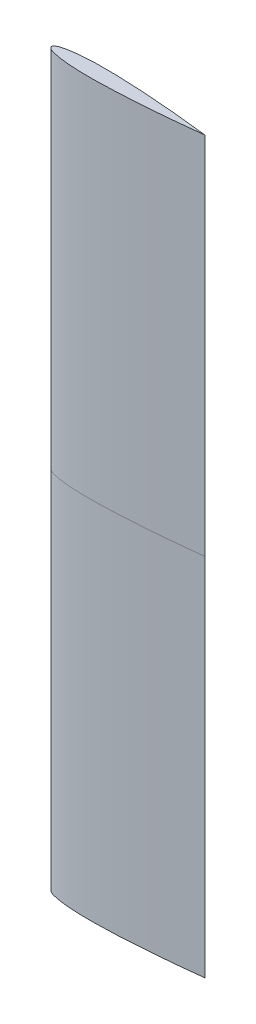
ISO-10303-21;
HEADER;
FILE_DESCRIPTION(('STEP AP214'),'2;1');
FILE_NAME('part.step','',(''),(''),'','','');
FILE_SCHEMA(('AUTOMOTIVE_DESIGN { 1 0 10303 214 1 1 1 1 }'));
ENDSEC;
DATA;
#1=APPLICATION_CONTEXT('core data for automotive mechanical design processes');
#2=APPLICATION_PROTOCOL_DEFINITION('international standard','automotive_design',2000,#1);
#3=PRODUCT_CONTEXT('',#1,'mechanical');
#4=PRODUCT('Part','Part','',(#3));
#5=PRODUCT_RELATED_PRODUCT_CATEGORY('part','',(#4));
#6=PRODUCT_DEFINITION_FORMATION('','',#4);
#7=PRODUCT_DEFINITION_CONTEXT('part definition',#1,'design');
#8=PRODUCT_DEFINITION('design','',#6,#7);
#9=PRODUCT_DEFINITION_SHAPE('','',#8);
#10=(LENGTH_UNIT() NAMED_UNIT(*) SI_UNIT(.MILLI.,.METRE.));
#11=(NAMED_UNIT(*) PLANE_ANGLE_UNIT() SI_UNIT($,.RADIAN.));
#12=(NAMED_UNIT(*) SI_UNIT($,.STERADIAN.) SOLID_ANGLE_UNIT());
#13=UNCERTAINTY_MEASURE_WITH_UNIT(LENGTH_MEASURE(1.E-05),#10,'distance_accuracy_value','');
#14=(GEOMETRIC_REPRESENTATION_CONTEXT(3) GLOBAL_UNCERTAINTY_ASSIGNED_CONTEXT((#13)) GLOBAL_UNIT_ASSIGNED_CONTEXT((#10,
#11,#12)) REPRESENTATION_CONTEXT('',''));
#15=CARTESIAN_POINT('',(0.,0.,0.));
#16=DIRECTION('',(0.,0.,1.));
#17=DIRECTION('',(1.,0.,0.));
#18=AXIS2_PLACEMENT_3D('',#15,#16,#17);
#19=CARTESIAN_POINT('',(123.679544009978,594.,11.0823047088799));
#20=DIRECTION('',(0.,-1.,0.));
#21=DIRECTION('',(0.,0.,-1.));
#22=AXIS2_PLACEMENT_3D('',#19,#20,#21);
#23=PLANE('',#22);
#24=CARTESIAN_POINT('',(0.,594.,0.));
#25=CARTESIAN_POINT('',(0.000103465461850672,594.,0.195763512006859));
#26=CARTESIAN_POINT('',(0.0282937675893524,594.,0.49275948932096));
#27=CARTESIAN_POINT('',(0.127222575715822,594.,0.894156676826667));
#28=CARTESIAN_POINT('',(0.343186548936814,594.,1.37851414413776));
#29=CARTESIAN_POINT('',(0.594318401197752,594.,1.79362736690841));
#30=CARTESIAN_POINT('',(0.950055747207749,594.,2.24992156578818));
#31=CARTESIAN_POINT('',(1.4713817310606,594.,2.77982678568887));
#32=CARTESIAN_POINT('',(2.27928272202513,594.,3.43103542933765));
#33=CARTESIAN_POINT('',(3.60301808997942,594.,4.26867348456868));
#34=CARTESIAN_POINT('',(5.87080256138,594.,5.36694464132199));
#35=CARTESIAN_POINT('',(9.93005594704726,594.,6.81744902969003));
#36=CARTESIAN_POINT('',(17.1522364090774,594.,8.61221967301249));
#37=CARTESIAN_POINT('',(28.7202751218391,594.,10.4478744854177));
#38=CARTESIAN_POINT('',(44.1684650962549,594.,11.8206275366375));
#39=CARTESIAN_POINT('',(62.5424327947028,594.,12.5283181046379));
#40=CARTESIAN_POINT('',(82.333782025023,594.,12.568468879676));
#41=CARTESIAN_POINT('',(99.6449646532138,594.,12.1538260813693));
#42=CARTESIAN_POINT('',(114.474754261623,594.,11.5581675136075));
#43=CARTESIAN_POINT('',(126.826489093191,594.,10.9293163636052));
#44=CARTESIAN_POINT('',(136.704306809029,594.,10.3556638722033));
#45=CARTESIAN_POINT('',(146.577662719965,594.,9.71900697547606));
#46=CARTESIAN_POINT('',(156.448177874923,594.,9.02497718725072));
#47=CARTESIAN_POINT('',(166.313103965573,594.,8.2785317699661));
#48=CARTESIAN_POINT('',(176.177102825749,594.,7.48246039010343));
#49=CARTESIAN_POINT('',(186.032159331356,594.,6.64002112873897));
#50=CARTESIAN_POINT('',(194.659964932203,594.,5.86186982694942));
#51=CARTESIAN_POINT('',(202.039567164669,594.,5.16803750733003));
#52=CARTESIAN_POINT('',(208.208074403685,594.,4.5681769064419));
#53=CARTESIAN_POINT('',(213.104800748353,594.,4.08112666426382));
#54=CARTESIAN_POINT('',(218.075005881044,594.,3.57319925968496));
#55=CARTESIAN_POINT('',(222.911526958763,594.,3.06923205943349));
#56=CARTESIAN_POINT('',(227.970719553252,594.,2.52575020770454));
#57=CARTESIAN_POINT('',(232.65606805684,594.,2.01464323215435));
#58=CARTESIAN_POINT('',(237.956379070475,594.,1.41572539242728));
#59=CARTESIAN_POINT('',(242.233232429836,594.,0.92698262908431));
#60=CARTESIAN_POINT('',(246.711229679291,594.,0.395821130938007));
#61=CARTESIAN_POINT('',(248.883194299176,594.,0.135273090512263));
#62=CARTESIAN_POINT('',(250.000000000002,594.,-1.93104770240191E-13));
#63=B_SPLINE_CURVE_WITH_KNOTS('',4,(#24,#25,#26,#27,#28,#29,#30,#31,#32,#33,#34,#35,#36,#37,#38,
#39,#40,#41,#42,#43,#44,#45,#46,#47,#48,#49,#50,#51,#52,#53,#54,#55,#56,#57,#58,#59,#60,#61,
#62),.UNSPECIFIED.,.F.,.F.,(5,1,1,1,1,1,1,1,1,1,1,1,1,1,1,1,1,1,1,1,1,1,1,1,1,1,1,1,1,1,1,1,1,1,
1,5),(0.,0.00279140045981441,0.00428053383451514,0.00588271915769683,0.00758509894245763,
0.00973465740831715,0.012561594838598,0.0165224026835013,0.022438150700394,0.0321580273460901,
0.0486342403302747,0.0782486520746178,0.129036717083551,0.19999701137119,0.270957306932518,
0.341917602300949,0.412877898163758,0.448358046299363,0.483838194434969,0.519318342597852,
0.554798490760736,0.590278638864112,0.625758786967488,0.661238934992259,0.696719083017031,
0.73219923099426,0.749939304982875,0.76767937897149,0.785419453017184,0.803159527062879,
0.820899601108573,0.838639675154267,0.856379749558805,0.874119823963342,0.89185989836788,
0.909599972772417),.UNSPECIFIED.);
#64=CARTESIAN_POINT('',(0.,594.,0.));
#65=VERTEX_POINT('',#64);
#66=CARTESIAN_POINT('',(250.000000000002,594.,1.93104770240191E-13));
#67=VERTEX_POINT('',#66);
#68=EDGE_CURVE('E91',#65,#67,#63,.T.);
#69=ORIENTED_EDGE('',*,*,#68,.T.);
#70=CARTESIAN_POINT('',(250.000000000002,594.,1.93104770240191E-13));
#71=CARTESIAN_POINT('',(248.883194299176,594.,-0.135273090512263));
#72=CARTESIAN_POINT('',(246.711229679291,594.,-0.395821130938007));
#73=CARTESIAN_POINT('',(242.233232429836,594.,-0.92698262908431));
#74=CARTESIAN_POINT('',(237.956379070475,594.,-1.41572539242728));
#75=CARTESIAN_POINT('',(232.65606805684,594.,-2.01464323215435));
#76=CARTESIAN_POINT('',(227.970719553252,594.,-2.52575020770454));
#77=CARTESIAN_POINT('',(222.911526958763,594.,-3.06923205943349));
#78=CARTESIAN_POINT('',(218.075005881044,594.,-3.57319925968496));
#79=CARTESIAN_POINT('',(213.104800748353,594.,-4.08112666426382));
#80=CARTESIAN_POINT('',(208.208074403685,594.,-4.5681769064419));
#81=CARTESIAN_POINT('',(202.039567164669,594.,-5.16803750733003));
#82=CARTESIAN_POINT('',(194.659964932203,594.,-5.86186982694942));
#83=CARTESIAN_POINT('',(186.032159331356,594.,-6.64002112873897));
#84=CARTESIAN_POINT('',(176.177102825749,594.,-7.48246039010343));
#85=CARTESIAN_POINT('',(166.313103965573,594.,-8.2785317699661));
#86=CARTESIAN_POINT('',(156.448177874923,594.,-9.02497718725072));
#87=CARTESIAN_POINT('',(146.577662719965,594.,-9.71900697547606));
#88=CARTESIAN_POINT('',(136.704306809029,594.,-10.3556638722033));
#89=CARTESIAN_POINT('',(126.826489093191,594.,-10.9293163636052));
#90=CARTESIAN_POINT('',(114.474754261623,594.,-11.5581675136075));
#91=CARTESIAN_POINT('',(99.6449646532138,594.,-12.1538260813693));
#92=CARTESIAN_POINT('',(82.333782025023,594.,-12.568468879676));
#93=CARTESIAN_POINT('',(62.5424327947028,594.,-12.5283181046379));
#94=CARTESIAN_POINT('',(44.1684650962549,594.,-11.8206275366375));
#95=CARTESIAN_POINT('',(28.7202751218391,594.,-10.4478744854177));
#96=CARTESIAN_POINT('',(17.1522364090774,594.,-8.61221967301249));
#97=CARTESIAN_POINT('',(9.93005594704726,594.,-6.81744902969003));
#98=CARTESIAN_POINT('',(5.87080256138,594.,-5.36694464132199));
#99=CARTESIAN_POINT('',(3.60301808997942,594.,-4.26867348456868));
#100=CARTESIAN_POINT('',(2.27928272202513,594.,-3.43103542933765));
#101=CARTESIAN_POINT('',(1.4713817310606,594.,-2.77982678568887));
#102=CARTESIAN_POINT('',(0.950055747207749,594.,-2.24992156578818));
#103=CARTESIAN_POINT('',(0.594318401197752,594.,-1.79362736690841));
#104=CARTESIAN_POINT('',(0.343186548936814,594.,-1.37851414413776));
#105=CARTESIAN_POINT('',(0.127222575715822,594.,-0.894156676826667));
#106=CARTESIAN_POINT('',(0.0282937675893524,594.,-0.49275948932096));
#107=CARTESIAN_POINT('',(0.000103465461850672,594.,-0.195763512006859));
#108=CARTESIAN_POINT('',(0.,594.,0.));
#109=B_SPLINE_CURVE_WITH_KNOTS('',4,(#70,#71,#72,#73,#74,#75,#76,#77,#78,#79,#80,#81,#82,#83,
#84,#85,#86,#87,#88,#89,#90,#91,#92,#93,#94,#95,#96,#97,#98,#99,#100,#101,#102,#103,#104,#105,
#106,#107,#108),.UNSPECIFIED.,.F.,.F.,(5,1,1,1,1,1,1,1,1,1,1,1,1,1,1,1,1,1,1,1,1,1,1,1,1,1,1,1,
1,1,1,1,1,1,1,5),(0.,0.0177400744045375,0.035480148809075,0.0532202232136125,0.07096029761815,
0.0887003716638443,0.106440445709539,0.124180519755233,0.141920593800927,0.159660667789542,
0.177400741778157,0.212880889755386,0.248361037780158,0.28384118580493,0.319321333908306,
0.354801482011681,0.390281630174565,0.425761778337449,0.461241926473054,0.496722074608659,
0.567682370471468,0.638642665839899,0.709602961401227,0.780563255688866,0.831351320697799,
0.860965732442143,0.877441945426327,0.887161822072023,0.893077570088916,0.897038377933819,
0.8998653153641,0.90201487382996,0.90371725361472,0.905319438937902,0.906808572312603,
0.909599972772417),.UNSPECIFIED.);
#110=EDGE_CURVE('E12',#67,#65,#109,.T.);
#111=ORIENTED_EDGE('',*,*,#110,.T.);
#112=EDGE_LOOP('',(#69,#111));
#113=FACE_BOUND('',#112,.T.);
#114=ADVANCED_FACE('F81',(#113),#23,.F.);
#115=CARTESIAN_POINT('',(0.,0.,0.));
#116=CARTESIAN_POINT('',(0.,594.,0.));
#117=CARTESIAN_POINT('',(0.000103465461850672,0.,0.195763512006859));
#118=CARTESIAN_POINT('',(0.000103465461850672,594.,0.195763512006859));
#119=CARTESIAN_POINT('',(0.0282937675893524,0.,0.49275948932096));
#120=CARTESIAN_POINT('',(0.0282937675893524,594.,0.49275948932096));
#121=CARTESIAN_POINT('',(0.127222575715822,0.,0.894156676826667));
#122=CARTESIAN_POINT('',(0.127222575715822,594.,0.894156676826667));
#123=CARTESIAN_POINT('',(0.343186548936814,0.,1.37851414413776));
#124=CARTESIAN_POINT('',(0.343186548936814,594.,1.37851414413776));
#125=CARTESIAN_POINT('',(0.594318401197752,0.,1.79362736690841));
#126=CARTESIAN_POINT('',(0.594318401197752,594.,1.79362736690841));
#127=CARTESIAN_POINT('',(0.950055747207749,0.,2.24992156578818));
#128=CARTESIAN_POINT('',(0.950055747207749,594.,2.24992156578818));
#129=CARTESIAN_POINT('',(1.4713817310606,0.,2.77982678568887));
#130=CARTESIAN_POINT('',(1.4713817310606,594.,2.77982678568887));
#131=CARTESIAN_POINT('',(2.27928272202513,0.,3.43103542933765));
#132=CARTESIAN_POINT('',(2.27928272202513,594.,3.43103542933765));
#133=CARTESIAN_POINT('',(3.60301808997942,0.,4.26867348456868));
#134=CARTESIAN_POINT('',(3.60301808997942,594.,4.26867348456868));
#135=CARTESIAN_POINT('',(5.87080256138,0.,5.36694464132199));
#136=CARTESIAN_POINT('',(5.87080256138,594.,5.36694464132199));
#137=CARTESIAN_POINT('',(9.93005594704726,0.,6.81744902969003));
#138=CARTESIAN_POINT('',(9.93005594704726,594.,6.81744902969003));
#139=CARTESIAN_POINT('',(17.1522364090774,0.,8.61221967301249));
#140=CARTESIAN_POINT('',(17.1522364090774,594.,8.61221967301249));
#141=CARTESIAN_POINT('',(28.7202751218391,0.,10.4478744854177));
#142=CARTESIAN_POINT('',(28.7202751218391,594.,10.4478744854177));
#143=CARTESIAN_POINT('',(44.1684650962549,0.,11.8206275366375));
#144=CARTESIAN_POINT('',(44.1684650962549,594.,11.8206275366375));
#145=CARTESIAN_POINT('',(62.5424327947028,0.,12.5283181046379));
#146=CARTESIAN_POINT('',(62.5424327947028,594.,12.5283181046379));
#147=CARTESIAN_POINT('',(82.333782025023,0.,12.568468879676));
#148=CARTESIAN_POINT('',(82.333782025023,594.,12.568468879676));
#149=CARTESIAN_POINT('',(99.6449646532138,0.,12.1538260813693));
#150=CARTESIAN_POINT('',(99.6449646532138,594.,12.1538260813693));
#151=CARTESIAN_POINT('',(114.474754261623,0.,11.5581675136075));
#152=CARTESIAN_POINT('',(114.474754261623,594.,11.5581675136075));
#153=CARTESIAN_POINT('',(126.826489093191,0.,10.9293163636052));
#154=CARTESIAN_POINT('',(126.826489093191,594.,10.9293163636052));
#155=CARTESIAN_POINT('',(136.704306809029,0.,10.3556638722033));
#156=CARTESIAN_POINT('',(136.704306809029,594.,10.3556638722033));
#157=CARTESIAN_POINT('',(146.577662719965,0.,9.71900697547606));
#158=CARTESIAN_POINT('',(146.577662719965,594.,9.71900697547606));
#159=CARTESIAN_POINT('',(156.448177874923,0.,9.02497718725072));
#160=CARTESIAN_POINT('',(156.448177874923,594.,9.02497718725072));
#161=CARTESIAN_POINT('',(166.313103965573,0.,8.2785317699661));
#162=CARTESIAN_POINT('',(166.313103965573,594.,8.2785317699661));
#163=CARTESIAN_POINT('',(176.177102825749,0.,7.48246039010343));
#164=CARTESIAN_POINT('',(176.177102825749,594.,7.48246039010343));
#165=CARTESIAN_POINT('',(186.032159331356,0.,6.64002112873897));
#166=CARTESIAN_POINT('',(186.032159331356,594.,6.64002112873897));
#167=CARTESIAN_POINT('',(194.659964932203,0.,5.86186982694942));
#168=CARTESIAN_POINT('',(194.659964932203,594.,5.86186982694942));
#169=CARTESIAN_POINT('',(202.039567164669,0.,5.16803750733003));
#170=CARTESIAN_POINT('',(202.039567164669,594.,5.16803750733003));
#171=CARTESIAN_POINT('',(208.208074403685,0.,4.5681769064419));
#172=CARTESIAN_POINT('',(208.208074403685,594.,4.5681769064419));
#173=CARTESIAN_POINT('',(213.104800748353,0.,4.08112666426382));
#174=CARTESIAN_POINT('',(213.104800748353,594.,4.08112666426382));
#175=CARTESIAN_POINT('',(218.075005881044,0.,3.57319925968496));
#176=CARTESIAN_POINT('',(218.075005881044,594.,3.57319925968496));
#177=CARTESIAN_POINT('',(222.911526958763,0.,3.06923205943349));
#178=CARTESIAN_POINT('',(222.911526958763,594.,3.06923205943349));
#179=CARTESIAN_POINT('',(227.970719553252,0.,2.52575020770454));
#180=CARTESIAN_POINT('',(227.970719553252,594.,2.52575020770454));
#181=CARTESIAN_POINT('',(232.65606805684,0.,2.01464323215435));
#182=CARTESIAN_POINT('',(232.65606805684,594.,2.01464323215435));
#183=CARTESIAN_POINT('',(237.956379070475,0.,1.41572539242728));
#184=CARTESIAN_POINT('',(237.956379070475,594.,1.41572539242728));
#185=CARTESIAN_POINT('',(242.233232429836,0.,0.92698262908431));
#186=CARTESIAN_POINT('',(242.233232429836,594.,0.92698262908431));
#187=CARTESIAN_POINT('',(246.711229679291,0.,0.395821130938007));
#188=CARTESIAN_POINT('',(246.711229679291,594.,0.395821130938007));
#189=CARTESIAN_POINT('',(248.883194299176,0.,0.135273090512263));
#190=CARTESIAN_POINT('',(248.883194299176,594.,0.135273090512263));
#191=CARTESIAN_POINT('',(250.000000000002,0.,-1.93104770240191E-13));
#192=CARTESIAN_POINT('',(250.000000000002,594.,-1.93104770240191E-13));
#193=B_SPLINE_SURFACE_WITH_KNOTS('',4,1,((#115,#116),(#117,#118),(#119,#120),(#121,#122),(#123,
#124),(#125,#126),(#127,#128),(#129,#130),(#131,#132),(#133,#134),(#135,#136),(#137,#138),(#139,
#140),(#141,#142),(#143,#144),(#145,#146),(#147,#148),(#149,#150),(#151,#152),(#153,#154),(#155,
#156),(#157,#158),(#159,#160),(#161,#162),(#163,#164),(#165,#166),(#167,#168),(#169,#170),(#171,
#172),(#173,#174),(#175,#176),(#177,#178),(#179,#180),(#181,#182),(#183,#184),(#185,#186),(#187,
#188),(#189,#190),(#191,#192)),.UNSPECIFIED.,.F.,.F.,.F.,(5,1,1,1,1,1,1,1,1,1,1,1,1,1,1,1,1,1,1,
1,1,1,1,1,1,1,1,1,1,1,1,1,1,1,1,5),(2,2),(0.,0.003068822057356,0.00470595202577708,
0.00646736954022391,0.00833893928046041,0.0107021302767264,0.0138100211242431,0.018164471391904,
0.0246681523439404,0.035354032881151,0.0534677240392167,0.0860253456649957,0.141860950908181,
0.219873589883263,0.297886230258619,0.375898870421907,0.453911511128707,0.492917831706601,
0.531924152284496,0.57093047289238,0.609936793500264,0.648943114042727,0.687949434585189,
0.726955755041235,0.765962075497281,0.80496839590106,0.82447155610295,0.843974716304839,
0.863477876569481,0.882981036834123,0.902484197098764,0.921987357363406,0.941490518022555,
0.960993678681703,0.980496839340852,1.),(0.,1.),.UNSPECIFIED.);
#194=CARTESIAN_POINT('',(0.,0.,0.));
#195=CARTESIAN_POINT('',(0.000103465461850672,0.,0.195763512006859));
#196=CARTESIAN_POINT('',(0.0282937675893524,0.,0.49275948932096));
#197=CARTESIAN_POINT('',(0.127222575715822,0.,0.894156676826667));
#198=CARTESIAN_POINT('',(0.343186548936814,0.,1.37851414413776));
#199=CARTESIAN_POINT('',(0.594318401197752,0.,1.79362736690841));
#200=CARTESIAN_POINT('',(0.950055747207749,0.,2.24992156578818));
#201=CARTESIAN_POINT('',(1.4713817310606,0.,2.77982678568887));
#202=CARTESIAN_POINT('',(2.27928272202513,0.,3.43103542933765));
#203=CARTESIAN_POINT('',(3.60301808997942,0.,4.26867348456868));
#204=CARTESIAN_POINT('',(5.87080256138,0.,5.36694464132199));
#205=CARTESIAN_POINT('',(9.93005594704726,0.,6.81744902969003));
#206=CARTESIAN_POINT('',(17.1522364090774,0.,8.61221967301249));
#207=CARTESIAN_POINT('',(28.7202751218391,0.,10.4478744854177));
#208=CARTESIAN_POINT('',(44.1684650962549,0.,11.8206275366375));
#209=CARTESIAN_POINT('',(62.5424327947028,0.,12.5283181046379));
#210=CARTESIAN_POINT('',(82.333782025023,0.,12.568468879676));
#211=CARTESIAN_POINT('',(99.6449646532138,0.,12.1538260813693));
#212=CARTESIAN_POINT('',(114.474754261623,0.,11.5581675136075));
#213=CARTESIAN_POINT('',(126.826489093191,0.,10.9293163636052));
#214=CARTESIAN_POINT('',(136.704306809029,0.,10.3556638722033));
#215=CARTESIAN_POINT('',(146.577662719965,0.,9.71900697547606));
#216=CARTESIAN_POINT('',(156.448177874923,0.,9.02497718725072));
#217=CARTESIAN_POINT('',(166.313103965573,0.,8.2785317699661));
#218=CARTESIAN_POINT('',(176.177102825749,0.,7.48246039010343));
#219=CARTESIAN_POINT('',(186.032159331356,0.,6.64002112873897));
#220=CARTESIAN_POINT('',(194.659964932203,0.,5.86186982694942));
#221=CARTESIAN_POINT('',(202.039567164669,0.,5.16803750733003));
#222=CARTESIAN_POINT('',(208.208074403685,0.,4.5681769064419));
#223=CARTESIAN_POINT('',(213.104800748353,0.,4.08112666426382));
#224=CARTESIAN_POINT('',(218.075005881044,0.,3.57319925968496));
#225=CARTESIAN_POINT('',(222.911526958763,0.,3.06923205943349));
#226=CARTESIAN_POINT('',(227.970719553252,0.,2.52575020770454));
#227=CARTESIAN_POINT('',(232.65606805684,0.,2.01464323215435));
#228=CARTESIAN_POINT('',(237.956379070475,0.,1.41572539242728));
#229=CARTESIAN_POINT('',(242.233232429836,0.,0.92698262908431));
#230=CARTESIAN_POINT('',(246.711229679291,0.,0.395821130938007));
#231=CARTESIAN_POINT('',(248.883194299176,0.,0.135273090512263));
#232=CARTESIAN_POINT('',(250.000000000002,0.,-1.93104770240191E-13));
#233=B_SPLINE_CURVE_WITH_KNOTS('',4,(#194,#195,#196,#197,#198,#199,#200,#201,#202,#203,#204,
#205,#206,#207,#208,#209,#210,#211,#212,#213,#214,#215,#216,#217,#218,#219,#220,#221,#222,#223,
#224,#225,#226,#227,#228,#229,#230,#231,#232),.UNSPECIFIED.,.F.,.F.,(5,1,1,1,1,1,1,1,1,1,1,1,1,
1,1,1,1,1,1,1,1,1,1,1,1,1,1,1,1,1,1,1,1,1,1,5),(0.,0.00279140045981441,0.00428053383451514,
0.00588271915769683,0.00758509894245763,0.00973465740831715,0.012561594838598,
0.0165224026835013,0.022438150700394,0.0321580273460901,0.0486342403302747,0.0782486520746178,
0.129036717083551,0.19999701137119,0.270957306932518,0.341917602300949,0.412877898163758,
0.448358046299363,0.483838194434969,0.519318342597852,0.554798490760736,0.590278638864112,
0.625758786967488,0.661238934992259,0.696719083017031,0.73219923099426,0.749939304982875,
0.76767937897149,0.785419453017184,0.803159527062879,0.820899601108573,0.838639675154267,
0.856379749558805,0.874119823963342,0.89185989836788,0.909599972772417),.UNSPECIFIED.);
#234=CARTESIAN_POINT('',(0.,0.,0.));
#235=VERTEX_POINT('',#234);
#236=CARTESIAN_POINT('',(250.000000000002,0.,1.93104770240191E-13));
#237=VERTEX_POINT('',#236);
#238=EDGE_CURVE('E85',#235,#237,#233,.T.);
#239=DIRECTION('',(0.,1.,0.));
#240=VECTOR('',#239,1.);
#241=CARTESIAN_POINT('',(250.000000000002,297.,-1.93104770240191E-13));
#242=LINE('',#241,#240);
#243=EDGE_CURVE('E99',#237,#67,#242,.T.);
#244=DIRECTION('',(0.,-1.,0.));
#245=VECTOR('',#244,1.);
#246=CARTESIAN_POINT('',(0.,297.,0.));
#247=LINE('',#246,#245);
#248=EDGE_CURVE('E139',#65,#235,#247,.T.);
#249=ORIENTED_EDGE('',*,*,#238,.T.);
#250=ORIENTED_EDGE('',*,*,#243,.T.);
#251=ORIENTED_EDGE('',*,*,#68,.F.);
#252=ORIENTED_EDGE('',*,*,#248,.T.);
#253=EDGE_LOOP('',(#249,#250,#251,#252));
#254=FACE_BOUND('',#253,.T.);
#255=ADVANCED_FACE('F142',(#254),#193,.T.);
#256=CARTESIAN_POINT('',(250.000000000002,0.,1.93104770240191E-13));
#257=CARTESIAN_POINT('',(250.000000000002,594.,1.93104770240191E-13));
#258=CARTESIAN_POINT('',(248.883194299176,0.,-0.135273090512263));
#259=CARTESIAN_POINT('',(248.883194299176,594.,-0.135273090512263));
#260=CARTESIAN_POINT('',(246.711229679291,0.,-0.395821130938007));
#261=CARTESIAN_POINT('',(246.711229679291,594.,-0.395821130938007));
#262=CARTESIAN_POINT('',(242.233232429836,0.,-0.92698262908431));
#263=CARTESIAN_POINT('',(242.233232429836,594.,-0.92698262908431));
#264=CARTESIAN_POINT('',(237.956379070475,0.,-1.41572539242728));
#265=CARTESIAN_POINT('',(237.956379070475,594.,-1.41572539242728));
#266=CARTESIAN_POINT('',(232.65606805684,0.,-2.01464323215435));
#267=CARTESIAN_POINT('',(232.65606805684,594.,-2.01464323215435));
#268=CARTESIAN_POINT('',(227.970719553252,0.,-2.52575020770454));
#269=CARTESIAN_POINT('',(227.970719553252,594.,-2.52575020770454));
#270=CARTESIAN_POINT('',(222.911526958763,0.,-3.06923205943349));
#271=CARTESIAN_POINT('',(222.911526958763,594.,-3.06923205943349));
#272=CARTESIAN_POINT('',(218.075005881044,0.,-3.57319925968496));
#273=CARTESIAN_POINT('',(218.075005881044,594.,-3.57319925968496));
#274=CARTESIAN_POINT('',(213.104800748353,0.,-4.08112666426382));
#275=CARTESIAN_POINT('',(213.104800748353,594.,-4.08112666426382));
#276=CARTESIAN_POINT('',(208.208074403685,0.,-4.5681769064419));
#277=CARTESIAN_POINT('',(208.208074403685,594.,-4.5681769064419));
#278=CARTESIAN_POINT('',(202.039567164669,0.,-5.16803750733003));
#279=CARTESIAN_POINT('',(202.039567164669,594.,-5.16803750733003));
#280=CARTESIAN_POINT('',(194.659964932203,0.,-5.86186982694942));
#281=CARTESIAN_POINT('',(194.659964932203,594.,-5.86186982694942));
#282=CARTESIAN_POINT('',(186.032159331356,0.,-6.64002112873897));
#283=CARTESIAN_POINT('',(186.032159331356,594.,-6.64002112873897));
#284=CARTESIAN_POINT('',(176.177102825749,0.,-7.48246039010343));
#285=CARTESIAN_POINT('',(176.177102825749,594.,-7.48246039010343));
#286=CARTESIAN_POINT('',(166.313103965573,0.,-8.2785317699661));
#287=CARTESIAN_POINT('',(166.313103965573,594.,-8.2785317699661));
#288=CARTESIAN_POINT('',(156.448177874923,0.,-9.02497718725072));
#289=CARTESIAN_POINT('',(156.448177874923,594.,-9.02497718725072));
#290=CARTESIAN_POINT('',(146.577662719965,0.,-9.71900697547606));
#291=CARTESIAN_POINT('',(146.577662719965,594.,-9.71900697547606));
#292=CARTESIAN_POINT('',(136.704306809029,0.,-10.3556638722033));
#293=CARTESIAN_POINT('',(136.704306809029,594.,-10.3556638722033));
#294=CARTESIAN_POINT('',(126.826489093191,0.,-10.9293163636052));
#295=CARTESIAN_POINT('',(126.826489093191,594.,-10.9293163636052));
#296=CARTESIAN_POINT('',(114.474754261623,0.,-11.5581675136075));
#297=CARTESIAN_POINT('',(114.474754261623,594.,-11.5581675136075));
#298=CARTESIAN_POINT('',(99.6449646532138,0.,-12.1538260813693));
#299=CARTESIAN_POINT('',(99.6449646532138,594.,-12.1538260813693));
#300=CARTESIAN_POINT('',(82.333782025023,0.,-12.568468879676));
#301=CARTESIAN_POINT('',(82.333782025023,594.,-12.568468879676));
#302=CARTESIAN_POINT('',(62.5424327947028,0.,-12.5283181046379));
#303=CARTESIAN_POINT('',(62.5424327947028,594.,-12.5283181046379));
#304=CARTESIAN_POINT('',(44.1684650962549,0.,-11.8206275366375));
#305=CARTESIAN_POINT('',(44.1684650962549,594.,-11.8206275366375));
#306=CARTESIAN_POINT('',(28.7202751218391,0.,-10.4478744854177));
#307=CARTESIAN_POINT('',(28.7202751218391,594.,-10.4478744854177));
#308=CARTESIAN_POINT('',(17.1522364090774,0.,-8.61221967301249));
#309=CARTESIAN_POINT('',(17.1522364090774,594.,-8.61221967301249));
#310=CARTESIAN_POINT('',(9.93005594704726,0.,-6.81744902969003));
#311=CARTESIAN_POINT('',(9.93005594704726,594.,-6.81744902969003));
#312=CARTESIAN_POINT('',(5.87080256138,0.,-5.36694464132199));
#313=CARTESIAN_POINT('',(5.87080256138,594.,-5.36694464132199));
#314=CARTESIAN_POINT('',(3.60301808997942,0.,-4.26867348456868));
#315=CARTESIAN_POINT('',(3.60301808997942,594.,-4.26867348456868));
#316=CARTESIAN_POINT('',(2.27928272202513,0.,-3.43103542933765));
#317=CARTESIAN_POINT('',(2.27928272202513,594.,-3.43103542933765));
#318=CARTESIAN_POINT('',(1.4713817310606,0.,-2.77982678568887));
#319=CARTESIAN_POINT('',(1.4713817310606,594.,-2.77982678568887));
#320=CARTESIAN_POINT('',(0.950055747207749,0.,-2.24992156578818));
#321=CARTESIAN_POINT('',(0.950055747207749,594.,-2.24992156578818));
#322=CARTESIAN_POINT('',(0.594318401197752,0.,-1.79362736690841));
#323=CARTESIAN_POINT('',(0.594318401197752,594.,-1.79362736690841));
#324=CARTESIAN_POINT('',(0.343186548936814,0.,-1.37851414413776));
#325=CARTESIAN_POINT('',(0.343186548936814,594.,-1.37851414413776));
#326=CARTESIAN_POINT('',(0.127222575715822,0.,-0.894156676826667));
#327=CARTESIAN_POINT('',(0.127222575715822,594.,-0.894156676826667));
#328=CARTESIAN_POINT('',(0.0282937675893524,0.,-0.49275948932096));
#329=CARTESIAN_POINT('',(0.0282937675893524,594.,-0.49275948932096));
#330=CARTESIAN_POINT('',(0.000103465461850672,0.,-0.195763512006859));
#331=CARTESIAN_POINT('',(0.000103465461850672,594.,-0.195763512006859));
#332=CARTESIAN_POINT('',(0.,0.,0.));
#333=CARTESIAN_POINT('',(0.,594.,0.));
#334=B_SPLINE_SURFACE_WITH_KNOTS('',4,1,((#256,#257),(#258,#259),(#260,#261),(#262,#263),(#264,
#265),(#266,#267),(#268,#269),(#270,#271),(#272,#273),(#274,#275),(#276,#277),(#278,#279),(#280,
#281),(#282,#283),(#284,#285),(#286,#287),(#288,#289),(#290,#291),(#292,#293),(#294,#295),(#296,
#297),(#298,#299),(#300,#301),(#302,#303),(#304,#305),(#306,#307),(#308,#309),(#310,#311),(#312,
#313),(#314,#315),(#316,#317),(#318,#319),(#320,#321),(#322,#323),(#324,#325),(#326,#327),(#328,
#329),(#330,#331),(#332,#333)),.UNSPECIFIED.,.F.,.F.,.F.,(5,1,1,1,1,1,1,1,1,1,1,1,1,1,1,1,1,1,1,
1,1,1,1,1,1,1,1,1,1,1,1,1,1,1,1,5),(2,2),(0.,0.0195031606591484,0.0390063213182969,
0.0585094819774453,0.0780126426365938,0.0975158029012355,0.117018963165877,0.136522123430519,
0.156025283695161,0.175528443897051,0.19503160409894,0.234037924502719,0.273044244958765,
0.312050565414811,0.351056885957273,0.390063206499736,0.42906952710762,0.468075847715504,
0.507082168293399,0.546088488871293,0.624101129578093,0.702113769741381,0.780126410116737,
0.858139049091819,0.913974654335004,0.946532275960783,0.964645967118849,0.97533184765606,
0.981835528608096,0.986189978875757,0.989297869723274,0.99166106071954,0.993532630459776,
0.995294047974223,0.996931177942644,1.),(0.,1.),.UNSPECIFIED.);
#335=CARTESIAN_POINT('',(250.000000000002,0.,1.93104770240191E-13));
#336=CARTESIAN_POINT('',(248.883194299176,0.,-0.135273090512263));
#337=CARTESIAN_POINT('',(246.711229679291,0.,-0.395821130938007));
#338=CARTESIAN_POINT('',(242.233232429836,0.,-0.92698262908431));
#339=CARTESIAN_POINT('',(237.956379070475,0.,-1.41572539242728));
#340=CARTESIAN_POINT('',(232.65606805684,0.,-2.01464323215435));
#341=CARTESIAN_POINT('',(227.970719553252,0.,-2.52575020770454));
#342=CARTESIAN_POINT('',(222.911526958763,0.,-3.06923205943349));
#343=CARTESIAN_POINT('',(218.075005881044,0.,-3.57319925968496));
#344=CARTESIAN_POINT('',(213.104800748353,0.,-4.08112666426382));
#345=CARTESIAN_POINT('',(208.208074403685,0.,-4.5681769064419));
#346=CARTESIAN_POINT('',(202.039567164669,0.,-5.16803750733003));
#347=CARTESIAN_POINT('',(194.659964932203,0.,-5.86186982694942));
#348=CARTESIAN_POINT('',(186.032159331356,0.,-6.64002112873897));
#349=CARTESIAN_POINT('',(176.177102825749,0.,-7.48246039010343));
#350=CARTESIAN_POINT('',(166.313103965573,0.,-8.2785317699661));
#351=CARTESIAN_POINT('',(156.448177874923,0.,-9.02497718725072));
#352=CARTESIAN_POINT('',(146.577662719965,0.,-9.71900697547606));
#353=CARTESIAN_POINT('',(136.704306809029,0.,-10.3556638722033));
#354=CARTESIAN_POINT('',(126.826489093191,0.,-10.9293163636052));
#355=CARTESIAN_POINT('',(114.474754261623,0.,-11.5581675136075));
#356=CARTESIAN_POINT('',(99.6449646532138,0.,-12.1538260813693));
#357=CARTESIAN_POINT('',(82.333782025023,0.,-12.568468879676));
#358=CARTESIAN_POINT('',(62.5424327947028,0.,-12.5283181046379));
#359=CARTESIAN_POINT('',(44.1684650962549,0.,-11.8206275366375));
#360=CARTESIAN_POINT('',(28.7202751218391,0.,-10.4478744854177));
#361=CARTESIAN_POINT('',(17.1522364090774,0.,-8.61221967301249));
#362=CARTESIAN_POINT('',(9.93005594704726,0.,-6.81744902969003));
#363=CARTESIAN_POINT('',(5.87080256138,0.,-5.36694464132199));
#364=CARTESIAN_POINT('',(3.60301808997942,0.,-4.26867348456868));
#365=CARTESIAN_POINT('',(2.27928272202513,0.,-3.43103542933765));
#366=CARTESIAN_POINT('',(1.4713817310606,0.,-2.77982678568887));
#367=CARTESIAN_POINT('',(0.950055747207749,0.,-2.24992156578818));
#368=CARTESIAN_POINT('',(0.594318401197752,0.,-1.79362736690841));
#369=CARTESIAN_POINT('',(0.343186548936814,0.,-1.37851414413776));
#370=CARTESIAN_POINT('',(0.127222575715822,0.,-0.894156676826667));
#371=CARTESIAN_POINT('',(0.0282937675893524,0.,-0.49275948932096));
#372=CARTESIAN_POINT('',(0.000103465461850672,0.,-0.195763512006859));
#373=CARTESIAN_POINT('',(0.,0.,0.));
#374=B_SPLINE_CURVE_WITH_KNOTS('',4,(#335,#336,#337,#338,#339,#340,#341,#342,#343,#344,#345,
#346,#347,#348,#349,#350,#351,#352,#353,#354,#355,#356,#357,#358,#359,#360,#361,#362,#363,#364,
#365,#366,#367,#368,#369,#370,#371,#372,#373),.UNSPECIFIED.,.F.,.F.,(5,1,1,1,1,1,1,1,1,1,1,1,1,
1,1,1,1,1,1,1,1,1,1,1,1,1,1,1,1,1,1,1,1,1,1,5),(0.,0.0177400744045375,0.035480148809075,
0.0532202232136125,0.07096029761815,0.0887003716638443,0.106440445709539,0.124180519755233,
0.141920593800927,0.159660667789542,0.177400741778157,0.212880889755386,0.248361037780158,
0.28384118580493,0.319321333908306,0.354801482011681,0.390281630174565,0.425761778337449,
0.461241926473054,0.496722074608659,0.567682370471468,0.638642665839899,0.709602961401227,
0.780563255688866,0.831351320697799,0.860965732442143,0.877441945426327,0.887161822072023,
0.893077570088916,0.897038377933819,0.8998653153641,0.90201487382996,0.90371725361472,
0.905319438937902,0.906808572312603,0.909599972772417),.UNSPECIFIED.);
#375=EDGE_CURVE('E132',#237,#235,#374,.T.);
#376=ORIENTED_EDGE('',*,*,#375,.T.);
#377=ORIENTED_EDGE('',*,*,#248,.F.);
#378=ORIENTED_EDGE('',*,*,#110,.F.);
#379=ORIENTED_EDGE('',*,*,#243,.F.);
#380=EDGE_LOOP('',(#376,#377,#378,#379));
#381=FACE_BOUND('',#380,.T.);
#382=ADVANCED_FACE('F146',(#381),#334,.T.);
#383=CARTESIAN_POINT('',(123.679544009978,-594.,11.0823047088799));
#384=DIRECTION('',(0.,1.,0.));
#385=DIRECTION('',(0.,0.,-1.));
#386=AXIS2_PLACEMENT_3D('',#383,#384,#385);
#387=PLANE('',#386);
#388=CARTESIAN_POINT('',(0.,-594.,0.));
#389=CARTESIAN_POINT('',(0.000103465461850672,-594.,0.195763512006859));
#390=CARTESIAN_POINT('',(0.0282937675893524,-594.,0.49275948932096));
#391=CARTESIAN_POINT('',(0.127222575715822,-594.,0.894156676826667));
#392=CARTESIAN_POINT('',(0.343186548936814,-594.,1.37851414413776));
#393=CARTESIAN_POINT('',(0.594318401197752,-594.,1.79362736690841));
#394=CARTESIAN_POINT('',(0.950055747207749,-594.,2.24992156578818));
#395=CARTESIAN_POINT('',(1.4713817310606,-594.,2.77982678568887));
#396=CARTESIAN_POINT('',(2.27928272202513,-594.,3.43103542933765));
#397=CARTESIAN_POINT('',(3.60301808997942,-594.,4.26867348456868));
#398=CARTESIAN_POINT('',(5.87080256138,-594.,5.36694464132199));
#399=CARTESIAN_POINT('',(9.93005594704726,-594.,6.81744902969003));
#400=CARTESIAN_POINT('',(17.1522364090774,-594.,8.61221967301249));
#401=CARTESIAN_POINT('',(28.7202751218391,-594.,10.4478744854177));
#402=CARTESIAN_POINT('',(44.1684650962549,-594.,11.8206275366375));
#403=CARTESIAN_POINT('',(62.5424327947028,-594.,12.5283181046379));
#404=CARTESIAN_POINT('',(82.333782025023,-594.,12.568468879676));
#405=CARTESIAN_POINT('',(99.6449646532138,-594.,12.1538260813693));
#406=CARTESIAN_POINT('',(114.474754261623,-594.,11.5581675136075));
#407=CARTESIAN_POINT('',(126.826489093191,-594.,10.9293163636052));
#408=CARTESIAN_POINT('',(136.704306809029,-594.,10.3556638722033));
#409=CARTESIAN_POINT('',(146.577662719965,-594.,9.71900697547606));
#410=CARTESIAN_POINT('',(156.448177874923,-594.,9.02497718725072));
#411=CARTESIAN_POINT('',(166.313103965573,-594.,8.2785317699661));
#412=CARTESIAN_POINT('',(176.177102825749,-594.,7.48246039010343));
#413=CARTESIAN_POINT('',(186.032159331356,-594.,6.64002112873897));
#414=CARTESIAN_POINT('',(194.659964932203,-594.,5.86186982694942));
#415=CARTESIAN_POINT('',(202.039567164669,-594.,5.16803750733003));
#416=CARTESIAN_POINT('',(208.208074403685,-594.,4.5681769064419));
#417=CARTESIAN_POINT('',(213.104800748353,-594.,4.08112666426382));
#418=CARTESIAN_POINT('',(218.075005881044,-594.,3.57319925968496));
#419=CARTESIAN_POINT('',(222.911526958763,-594.,3.06923205943349));
#420=CARTESIAN_POINT('',(227.970719553252,-594.,2.52575020770454));
#421=CARTESIAN_POINT('',(232.65606805684,-594.,2.01464323215435));
#422=CARTESIAN_POINT('',(237.956379070475,-594.,1.41572539242728));
#423=CARTESIAN_POINT('',(242.233232429836,-594.,0.92698262908431));
#424=CARTESIAN_POINT('',(246.711229679291,-594.,0.395821130938007));
#425=CARTESIAN_POINT('',(248.883194299176,-594.,0.135273090512263));
#426=CARTESIAN_POINT('',(250.000000000002,-594.,-1.93104770240191E-13));
#427=B_SPLINE_CURVE_WITH_KNOTS('',4,(#388,#389,#390,#391,#392,#393,#394,#395,#396,#397,#398,
#399,#400,#401,#402,#403,#404,#405,#406,#407,#408,#409,#410,#411,#412,#413,#414,#415,#416,#417,
#418,#419,#420,#421,#422,#423,#424,#425,#426),.UNSPECIFIED.,.F.,.F.,(5,1,1,1,1,1,1,1,1,1,1,1,1,
1,1,1,1,1,1,1,1,1,1,1,1,1,1,1,1,1,1,1,1,1,1,5),(0.,0.00279140045981441,0.00428053383451514,
0.00588271915769683,0.00758509894245763,0.00973465740831715,0.012561594838598,
0.0165224026835013,0.022438150700394,0.0321580273460901,0.0486342403302747,0.0782486520746178,
0.129036717083551,0.19999701137119,0.270957306932518,0.341917602300949,0.412877898163758,
0.448358046299363,0.483838194434969,0.519318342597852,0.554798490760736,0.590278638864112,
0.625758786967488,0.661238934992259,0.696719083017031,0.73219923099426,0.749939304982875,
0.76767937897149,0.785419453017184,0.803159527062879,0.820899601108573,0.838639675154267,
0.856379749558805,0.874119823963342,0.89185989836788,0.909599972772417),.UNSPECIFIED.);
#428=CARTESIAN_POINT('',(0.,-594.,0.));
#429=VERTEX_POINT('',#428);
#430=CARTESIAN_POINT('',(250.000000000002,-594.,1.93104770240191E-13));
#431=VERTEX_POINT('',#430);
#432=EDGE_CURVE('E124',#429,#431,#427,.T.);
#433=ORIENTED_EDGE('',*,*,#432,.F.);
#434=CARTESIAN_POINT('',(250.000000000002,-594.,1.93104770240191E-13));
#435=CARTESIAN_POINT('',(248.883194299176,-594.,-0.135273090512263));
#436=CARTESIAN_POINT('',(246.711229679291,-594.,-0.395821130938007));
#437=CARTESIAN_POINT('',(242.233232429836,-594.,-0.92698262908431));
#438=CARTESIAN_POINT('',(237.956379070475,-594.,-1.41572539242728));
#439=CARTESIAN_POINT('',(232.65606805684,-594.,-2.01464323215435));
#440=CARTESIAN_POINT('',(227.970719553252,-594.,-2.52575020770454));
#441=CARTESIAN_POINT('',(222.911526958763,-594.,-3.06923205943349));
#442=CARTESIAN_POINT('',(218.075005881044,-594.,-3.57319925968496));
#443=CARTESIAN_POINT('',(213.104800748353,-594.,-4.08112666426382));
#444=CARTESIAN_POINT('',(208.208074403685,-594.,-4.5681769064419));
#445=CARTESIAN_POINT('',(202.039567164669,-594.,-5.16803750733003));
#446=CARTESIAN_POINT('',(194.659964932203,-594.,-5.86186982694942));
#447=CARTESIAN_POINT('',(186.032159331356,-594.,-6.64002112873897));
#448=CARTESIAN_POINT('',(176.177102825749,-594.,-7.48246039010343));
#449=CARTESIAN_POINT('',(166.313103965573,-594.,-8.2785317699661));
#450=CARTESIAN_POINT('',(156.448177874923,-594.,-9.02497718725072));
#451=CARTESIAN_POINT('',(146.577662719965,-594.,-9.71900697547606));
#452=CARTESIAN_POINT('',(136.704306809029,-594.,-10.3556638722033));
#453=CARTESIAN_POINT('',(126.826489093191,-594.,-10.9293163636052));
#454=CARTESIAN_POINT('',(114.474754261623,-594.,-11.5581675136075));
#455=CARTESIAN_POINT('',(99.6449646532138,-594.,-12.1538260813693));
#456=CARTESIAN_POINT('',(82.333782025023,-594.,-12.568468879676));
#457=CARTESIAN_POINT('',(62.5424327947028,-594.,-12.5283181046379));
#458=CARTESIAN_POINT('',(44.1684650962549,-594.,-11.8206275366375));
#459=CARTESIAN_POINT('',(28.7202751218391,-594.,-10.4478744854177));
#460=CARTESIAN_POINT('',(17.1522364090774,-594.,-8.61221967301249));
#461=CARTESIAN_POINT('',(9.93005594704726,-594.,-6.81744902969003));
#462=CARTESIAN_POINT('',(5.87080256138,-594.,-5.36694464132199));
#463=CARTESIAN_POINT('',(3.60301808997942,-594.,-4.26867348456868));
#464=CARTESIAN_POINT('',(2.27928272202513,-594.,-3.43103542933765));
#465=CARTESIAN_POINT('',(1.4713817310606,-594.,-2.77982678568887));
#466=CARTESIAN_POINT('',(0.950055747207749,-594.,-2.24992156578818));
#467=CARTESIAN_POINT('',(0.594318401197752,-594.,-1.79362736690841));
#468=CARTESIAN_POINT('',(0.343186548936814,-594.,-1.37851414413776));
#469=CARTESIAN_POINT('',(0.127222575715822,-594.,-0.894156676826667));
#470=CARTESIAN_POINT('',(0.0282937675893524,-594.,-0.49275948932096));
#471=CARTESIAN_POINT('',(0.000103465461850672,-594.,-0.195763512006859));
#472=CARTESIAN_POINT('',(0.,-594.,0.));
#473=B_SPLINE_CURVE_WITH_KNOTS('',4,(#434,#435,#436,#437,#438,#439,#440,#441,#442,#443,#444,
#445,#446,#447,#448,#449,#450,#451,#452,#453,#454,#455,#456,#457,#458,#459,#460,#461,#462,#463,
#464,#465,#466,#467,#468,#469,#470,#471,#472),.UNSPECIFIED.,.F.,.F.,(5,1,1,1,1,1,1,1,1,1,1,1,1,
1,1,1,1,1,1,1,1,1,1,1,1,1,1,1,1,1,1,1,1,1,1,5),(0.,0.0177400744045375,0.035480148809075,
0.0532202232136125,0.07096029761815,0.0887003716638443,0.106440445709539,0.124180519755233,
0.141920593800927,0.159660667789542,0.177400741778157,0.212880889755386,0.248361037780158,
0.28384118580493,0.319321333908306,0.354801482011681,0.390281630174565,0.425761778337449,
0.461241926473054,0.496722074608659,0.567682370471468,0.638642665839899,0.709602961401227,
0.780563255688866,0.831351320697799,0.860965732442143,0.877441945426327,0.887161822072023,
0.893077570088916,0.897038377933819,0.8998653153641,0.90201487382996,0.90371725361472,
0.905319438937902,0.906808572312603,0.909599972772417),.UNSPECIFIED.);
#474=EDGE_CURVE('E143',#431,#429,#473,.T.);
#475=ORIENTED_EDGE('',*,*,#474,.F.);
#476=EDGE_LOOP('',(#433,#475));
#477=FACE_BOUND('',#476,.T.);
#478=ADVANCED_FACE('F168',(#477),#387,.F.);
#479=CARTESIAN_POINT('',(0.,0.,0.));
#480=CARTESIAN_POINT('',(0.,-594.,0.));
#481=CARTESIAN_POINT('',(0.000103465461850672,0.,0.195763512006859));
#482=CARTESIAN_POINT('',(0.000103465461850672,-594.,0.195763512006859));
#483=CARTESIAN_POINT('',(0.0282937675893524,0.,0.49275948932096));
#484=CARTESIAN_POINT('',(0.0282937675893524,-594.,0.49275948932096));
#485=CARTESIAN_POINT('',(0.127222575715822,0.,0.894156676826667));
#486=CARTESIAN_POINT('',(0.127222575715822,-594.,0.894156676826667));
#487=CARTESIAN_POINT('',(0.343186548936814,0.,1.37851414413776));
#488=CARTESIAN_POINT('',(0.343186548936814,-594.,1.37851414413776));
#489=CARTESIAN_POINT('',(0.594318401197752,0.,1.79362736690841));
#490=CARTESIAN_POINT('',(0.594318401197752,-594.,1.79362736690841));
#491=CARTESIAN_POINT('',(0.950055747207749,0.,2.24992156578818));
#492=CARTESIAN_POINT('',(0.950055747207749,-594.,2.24992156578818));
#493=CARTESIAN_POINT('',(1.4713817310606,0.,2.77982678568887));
#494=CARTESIAN_POINT('',(1.4713817310606,-594.,2.77982678568887));
#495=CARTESIAN_POINT('',(2.27928272202513,0.,3.43103542933765));
#496=CARTESIAN_POINT('',(2.27928272202513,-594.,3.43103542933765));
#497=CARTESIAN_POINT('',(3.60301808997942,0.,4.26867348456868));
#498=CARTESIAN_POINT('',(3.60301808997942,-594.,4.26867348456868));
#499=CARTESIAN_POINT('',(5.87080256138,0.,5.36694464132199));
#500=CARTESIAN_POINT('',(5.87080256138,-594.,5.36694464132199));
#501=CARTESIAN_POINT('',(9.93005594704726,0.,6.81744902969003));
#502=CARTESIAN_POINT('',(9.93005594704726,-594.,6.81744902969003));
#503=CARTESIAN_POINT('',(17.1522364090774,0.,8.61221967301249));
#504=CARTESIAN_POINT('',(17.1522364090774,-594.,8.61221967301249));
#505=CARTESIAN_POINT('',(28.7202751218391,0.,10.4478744854177));
#506=CARTESIAN_POINT('',(28.7202751218391,-594.,10.4478744854177));
#507=CARTESIAN_POINT('',(44.1684650962549,0.,11.8206275366375));
#508=CARTESIAN_POINT('',(44.1684650962549,-594.,11.8206275366375));
#509=CARTESIAN_POINT('',(62.5424327947028,0.,12.5283181046379));
#510=CARTESIAN_POINT('',(62.5424327947028,-594.,12.5283181046379));
#511=CARTESIAN_POINT('',(82.333782025023,0.,12.568468879676));
#512=CARTESIAN_POINT('',(82.333782025023,-594.,12.568468879676));
#513=CARTESIAN_POINT('',(99.6449646532138,0.,12.1538260813693));
#514=CARTESIAN_POINT('',(99.6449646532138,-594.,12.1538260813693));
#515=CARTESIAN_POINT('',(114.474754261623,0.,11.5581675136075));
#516=CARTESIAN_POINT('',(114.474754261623,-594.,11.5581675136075));
#517=CARTESIAN_POINT('',(126.826489093191,0.,10.9293163636052));
#518=CARTESIAN_POINT('',(126.826489093191,-594.,10.9293163636052));
#519=CARTESIAN_POINT('',(136.704306809029,0.,10.3556638722033));
#520=CARTESIAN_POINT('',(136.704306809029,-594.,10.3556638722033));
#521=CARTESIAN_POINT('',(146.577662719965,0.,9.71900697547606));
#522=CARTESIAN_POINT('',(146.577662719965,-594.,9.71900697547606));
#523=CARTESIAN_POINT('',(156.448177874923,0.,9.02497718725072));
#524=CARTESIAN_POINT('',(156.448177874923,-594.,9.02497718725072));
#525=CARTESIAN_POINT('',(166.313103965573,0.,8.2785317699661));
#526=CARTESIAN_POINT('',(166.313103965573,-594.,8.2785317699661));
#527=CARTESIAN_POINT('',(176.177102825749,0.,7.48246039010343));
#528=CARTESIAN_POINT('',(176.177102825749,-594.,7.48246039010343));
#529=CARTESIAN_POINT('',(186.032159331356,0.,6.64002112873897));
#530=CARTESIAN_POINT('',(186.032159331356,-594.,6.64002112873897));
#531=CARTESIAN_POINT('',(194.659964932203,0.,5.86186982694942));
#532=CARTESIAN_POINT('',(194.659964932203,-594.,5.86186982694942));
#533=CARTESIAN_POINT('',(202.039567164669,0.,5.16803750733003));
#534=CARTESIAN_POINT('',(202.039567164669,-594.,5.16803750733003));
#535=CARTESIAN_POINT('',(208.208074403685,0.,4.5681769064419));
#536=CARTESIAN_POINT('',(208.208074403685,-594.,4.5681769064419));
#537=CARTESIAN_POINT('',(213.104800748353,0.,4.08112666426382));
#538=CARTESIAN_POINT('',(213.104800748353,-594.,4.08112666426382));
#539=CARTESIAN_POINT('',(218.075005881044,0.,3.57319925968496));
#540=CARTESIAN_POINT('',(218.075005881044,-594.,3.57319925968496));
#541=CARTESIAN_POINT('',(222.911526958763,0.,3.06923205943349));
#542=CARTESIAN_POINT('',(222.911526958763,-594.,3.06923205943349));
#543=CARTESIAN_POINT('',(227.970719553252,0.,2.52575020770454));
#544=CARTESIAN_POINT('',(227.970719553252,-594.,2.52575020770454));
#545=CARTESIAN_POINT('',(232.65606805684,0.,2.01464323215435));
#546=CARTESIAN_POINT('',(232.65606805684,-594.,2.01464323215435));
#547=CARTESIAN_POINT('',(237.956379070475,0.,1.41572539242728));
#548=CARTESIAN_POINT('',(237.956379070475,-594.,1.41572539242728));
#549=CARTESIAN_POINT('',(242.233232429836,0.,0.92698262908431));
#550=CARTESIAN_POINT('',(242.233232429836,-594.,0.92698262908431));
#551=CARTESIAN_POINT('',(246.711229679291,0.,0.395821130938007));
#552=CARTESIAN_POINT('',(246.711229679291,-594.,0.395821130938007));
#553=CARTESIAN_POINT('',(248.883194299176,0.,0.135273090512263));
#554=CARTESIAN_POINT('',(248.883194299176,-594.,0.135273090512263));
#555=CARTESIAN_POINT('',(250.000000000002,0.,-1.93104770240191E-13));
#556=CARTESIAN_POINT('',(250.000000000002,-594.,-1.93104770240191E-13));
#557=B_SPLINE_SURFACE_WITH_KNOTS('',4,1,((#479,#480),(#481,#482),(#483,#484),(#485,#486),(#487,
#488),(#489,#490),(#491,#492),(#493,#494),(#495,#496),(#497,#498),(#499,#500),(#501,#502),(#503,
#504),(#505,#506),(#507,#508),(#509,#510),(#511,#512),(#513,#514),(#515,#516),(#517,#518),(#519,
#520),(#521,#522),(#523,#524),(#525,#526),(#527,#528),(#529,#530),(#531,#532),(#533,#534),(#535,
#536),(#537,#538),(#539,#540),(#541,#542),(#543,#544),(#545,#546),(#547,#548),(#549,#550),(#551,
#552),(#553,#554),(#555,#556)),.UNSPECIFIED.,.F.,.F.,.F.,(5,1,1,1,1,1,1,1,1,1,1,1,1,1,1,1,1,1,1,
1,1,1,1,1,1,1,1,1,1,1,1,1,1,1,1,5),(2,2),(0.,0.003068822057356,0.00470595202577708,
0.00646736954022391,0.00833893928046041,0.0107021302767264,0.0138100211242431,0.018164471391904,
0.0246681523439404,0.035354032881151,0.0534677240392167,0.0860253456649957,0.141860950908181,
0.219873589883263,0.297886230258619,0.375898870421907,0.453911511128707,0.492917831706601,
0.531924152284496,0.57093047289238,0.609936793500264,0.648943114042727,0.687949434585189,
0.726955755041235,0.765962075497281,0.80496839590106,0.82447155610295,0.843974716304839,
0.863477876569481,0.882981036834123,0.902484197098764,0.921987357363406,0.941490518022555,
0.960993678681703,0.980496839340852,1.),(0.,1.),.UNSPECIFIED.);
#558=DIRECTION('',(0.,1.,0.));
#559=VECTOR('',#558,1.);
#560=CARTESIAN_POINT('',(0.,-297.,0.));
#561=LINE('',#560,#559);
#562=EDGE_CURVE('E129',#429,#235,#561,.T.);
#563=DIRECTION('',(0.,-1.,0.));
#564=VECTOR('',#563,1.);
#565=CARTESIAN_POINT('',(250.000000000002,-297.,-1.93104770240191E-13));
#566=LINE('',#565,#564);
#567=EDGE_CURVE('E118',#237,#431,#566,.T.);
#568=ORIENTED_EDGE('',*,*,#238,.F.);
#569=ORIENTED_EDGE('',*,*,#562,.F.);
#570=ORIENTED_EDGE('',*,*,#432,.T.);
#571=ORIENTED_EDGE('',*,*,#567,.F.);
#572=EDGE_LOOP('',(#568,#569,#570,#571));
#573=FACE_BOUND('',#572,.T.);
#574=ADVANCED_FACE('F120',(#573),#557,.F.);
#575=CARTESIAN_POINT('',(250.000000000002,0.,1.93104770240191E-13));
#576=CARTESIAN_POINT('',(250.000000000002,-594.,1.93104770240191E-13));
#577=CARTESIAN_POINT('',(248.883194299176,0.,-0.135273090512263));
#578=CARTESIAN_POINT('',(248.883194299176,-594.,-0.135273090512263));
#579=CARTESIAN_POINT('',(246.711229679291,0.,-0.395821130938007));
#580=CARTESIAN_POINT('',(246.711229679291,-594.,-0.395821130938007));
#581=CARTESIAN_POINT('',(242.233232429836,0.,-0.92698262908431));
#582=CARTESIAN_POINT('',(242.233232429836,-594.,-0.92698262908431));
#583=CARTESIAN_POINT('',(237.956379070475,0.,-1.41572539242728));
#584=CARTESIAN_POINT('',(237.956379070475,-594.,-1.41572539242728));
#585=CARTESIAN_POINT('',(232.65606805684,0.,-2.01464323215435));
#586=CARTESIAN_POINT('',(232.65606805684,-594.,-2.01464323215435));
#587=CARTESIAN_POINT('',(227.970719553252,0.,-2.52575020770454));
#588=CARTESIAN_POINT('',(227.970719553252,-594.,-2.52575020770454));
#589=CARTESIAN_POINT('',(222.911526958763,0.,-3.06923205943349));
#590=CARTESIAN_POINT('',(222.911526958763,-594.,-3.06923205943349));
#591=CARTESIAN_POINT('',(218.075005881044,0.,-3.57319925968496));
#592=CARTESIAN_POINT('',(218.075005881044,-594.,-3.57319925968496));
#593=CARTESIAN_POINT('',(213.104800748353,0.,-4.08112666426382));
#594=CARTESIAN_POINT('',(213.104800748353,-594.,-4.08112666426382));
#595=CARTESIAN_POINT('',(208.208074403685,0.,-4.5681769064419));
#596=CARTESIAN_POINT('',(208.208074403685,-594.,-4.5681769064419));
#597=CARTESIAN_POINT('',(202.039567164669,0.,-5.16803750733003));
#598=CARTESIAN_POINT('',(202.039567164669,-594.,-5.16803750733003));
#599=CARTESIAN_POINT('',(194.659964932203,0.,-5.86186982694942));
#600=CARTESIAN_POINT('',(194.659964932203,-594.,-5.86186982694942));
#601=CARTESIAN_POINT('',(186.032159331356,0.,-6.64002112873897));
#602=CARTESIAN_POINT('',(186.032159331356,-594.,-6.64002112873897));
#603=CARTESIAN_POINT('',(176.177102825749,0.,-7.48246039010343));
#604=CARTESIAN_POINT('',(176.177102825749,-594.,-7.48246039010343));
#605=CARTESIAN_POINT('',(166.313103965573,0.,-8.2785317699661));
#606=CARTESIAN_POINT('',(166.313103965573,-594.,-8.2785317699661));
#607=CARTESIAN_POINT('',(156.448177874923,0.,-9.02497718725072));
#608=CARTESIAN_POINT('',(156.448177874923,-594.,-9.02497718725072));
#609=CARTESIAN_POINT('',(146.577662719965,0.,-9.71900697547606));
#610=CARTESIAN_POINT('',(146.577662719965,-594.,-9.71900697547606));
#611=CARTESIAN_POINT('',(136.704306809029,0.,-10.3556638722033));
#612=CARTESIAN_POINT('',(136.704306809029,-594.,-10.3556638722033));
#613=CARTESIAN_POINT('',(126.826489093191,0.,-10.9293163636052));
#614=CARTESIAN_POINT('',(126.826489093191,-594.,-10.9293163636052));
#615=CARTESIAN_POINT('',(114.474754261623,0.,-11.5581675136075));
#616=CARTESIAN_POINT('',(114.474754261623,-594.,-11.5581675136075));
#617=CARTESIAN_POINT('',(99.6449646532138,0.,-12.1538260813693));
#618=CARTESIAN_POINT('',(99.6449646532138,-594.,-12.1538260813693));
#619=CARTESIAN_POINT('',(82.333782025023,0.,-12.568468879676));
#620=CARTESIAN_POINT('',(82.333782025023,-594.,-12.568468879676));
#621=CARTESIAN_POINT('',(62.5424327947028,0.,-12.5283181046379));
#622=CARTESIAN_POINT('',(62.5424327947028,-594.,-12.5283181046379));
#623=CARTESIAN_POINT('',(44.1684650962549,0.,-11.8206275366375));
#624=CARTESIAN_POINT('',(44.1684650962549,-594.,-11.8206275366375));
#625=CARTESIAN_POINT('',(28.7202751218391,0.,-10.4478744854177));
#626=CARTESIAN_POINT('',(28.7202751218391,-594.,-10.4478744854177));
#627=CARTESIAN_POINT('',(17.1522364090774,0.,-8.61221967301249));
#628=CARTESIAN_POINT('',(17.1522364090774,-594.,-8.61221967301249));
#629=CARTESIAN_POINT('',(9.93005594704726,0.,-6.81744902969003));
#630=CARTESIAN_POINT('',(9.93005594704726,-594.,-6.81744902969003));
#631=CARTESIAN_POINT('',(5.87080256138,0.,-5.36694464132199));
#632=CARTESIAN_POINT('',(5.87080256138,-594.,-5.36694464132199));
#633=CARTESIAN_POINT('',(3.60301808997942,0.,-4.26867348456868));
#634=CARTESIAN_POINT('',(3.60301808997942,-594.,-4.26867348456868));
#635=CARTESIAN_POINT('',(2.27928272202513,0.,-3.43103542933765));
#636=CARTESIAN_POINT('',(2.27928272202513,-594.,-3.43103542933765));
#637=CARTESIAN_POINT('',(1.4713817310606,0.,-2.77982678568887));
#638=CARTESIAN_POINT('',(1.4713817310606,-594.,-2.77982678568887));
#639=CARTESIAN_POINT('',(0.950055747207749,0.,-2.24992156578818));
#640=CARTESIAN_POINT('',(0.950055747207749,-594.,-2.24992156578818));
#641=CARTESIAN_POINT('',(0.594318401197752,0.,-1.79362736690841));
#642=CARTESIAN_POINT('',(0.594318401197752,-594.,-1.79362736690841));
#643=CARTESIAN_POINT('',(0.343186548936814,0.,-1.37851414413776));
#644=CARTESIAN_POINT('',(0.343186548936814,-594.,-1.37851414413776));
#645=CARTESIAN_POINT('',(0.127222575715822,0.,-0.894156676826667));
#646=CARTESIAN_POINT('',(0.127222575715822,-594.,-0.894156676826667));
#647=CARTESIAN_POINT('',(0.0282937675893524,0.,-0.49275948932096));
#648=CARTESIAN_POINT('',(0.0282937675893524,-594.,-0.49275948932096));
#649=CARTESIAN_POINT('',(0.000103465461850672,0.,-0.195763512006859));
#650=CARTESIAN_POINT('',(0.000103465461850672,-594.,-0.195763512006859));
#651=CARTESIAN_POINT('',(0.,0.,0.));
#652=CARTESIAN_POINT('',(0.,-594.,0.));
#653=B_SPLINE_SURFACE_WITH_KNOTS('',4,1,((#575,#576),(#577,#578),(#579,#580),(#581,#582),(#583,
#584),(#585,#586),(#587,#588),(#589,#590),(#591,#592),(#593,#594),(#595,#596),(#597,#598),(#599,
#600),(#601,#602),(#603,#604),(#605,#606),(#607,#608),(#609,#610),(#611,#612),(#613,#614),(#615,
#616),(#617,#618),(#619,#620),(#621,#622),(#623,#624),(#625,#626),(#627,#628),(#629,#630),(#631,
#632),(#633,#634),(#635,#636),(#637,#638),(#639,#640),(#641,#642),(#643,#644),(#645,#646),(#647,
#648),(#649,#650),(#651,#652)),.UNSPECIFIED.,.F.,.F.,.F.,(5,1,1,1,1,1,1,1,1,1,1,1,1,1,1,1,1,1,1,
1,1,1,1,1,1,1,1,1,1,1,1,1,1,1,1,5),(2,2),(0.,0.0195031606591484,0.0390063213182969,
0.0585094819774453,0.0780126426365938,0.0975158029012355,0.117018963165877,0.136522123430519,
0.156025283695161,0.175528443897051,0.19503160409894,0.234037924502719,0.273044244958765,
0.312050565414811,0.351056885957273,0.390063206499736,0.42906952710762,0.468075847715504,
0.507082168293399,0.546088488871293,0.624101129578093,0.702113769741381,0.780126410116737,
0.858139049091819,0.913974654335004,0.946532275960783,0.964645967118849,0.97533184765606,
0.981835528608096,0.986189978875757,0.989297869723274,0.99166106071954,0.993532630459776,
0.995294047974223,0.996931177942644,1.),(0.,1.),.UNSPECIFIED.);
#654=ORIENTED_EDGE('',*,*,#375,.F.);
#655=ORIENTED_EDGE('',*,*,#567,.T.);
#656=ORIENTED_EDGE('',*,*,#474,.T.);
#657=ORIENTED_EDGE('',*,*,#562,.T.);
#658=EDGE_LOOP('',(#654,#655,#656,#657));
#659=FACE_BOUND('',#658,.T.);
#660=ADVANCED_FACE('F134',(#659),#653,.F.);
#661=CLOSED_SHELL('',(#114,#255,#382,#478,#574,#660));
#662=MANIFOLD_SOLID_BREP('B2',#661);
#663=ADVANCED_BREP_SHAPE_REPRESENTATION('',(#18,#662),#14);
#664=SHAPE_DEFINITION_REPRESENTATION(#9,#663);
ENDSEC;
END-ISO-10303-21;
